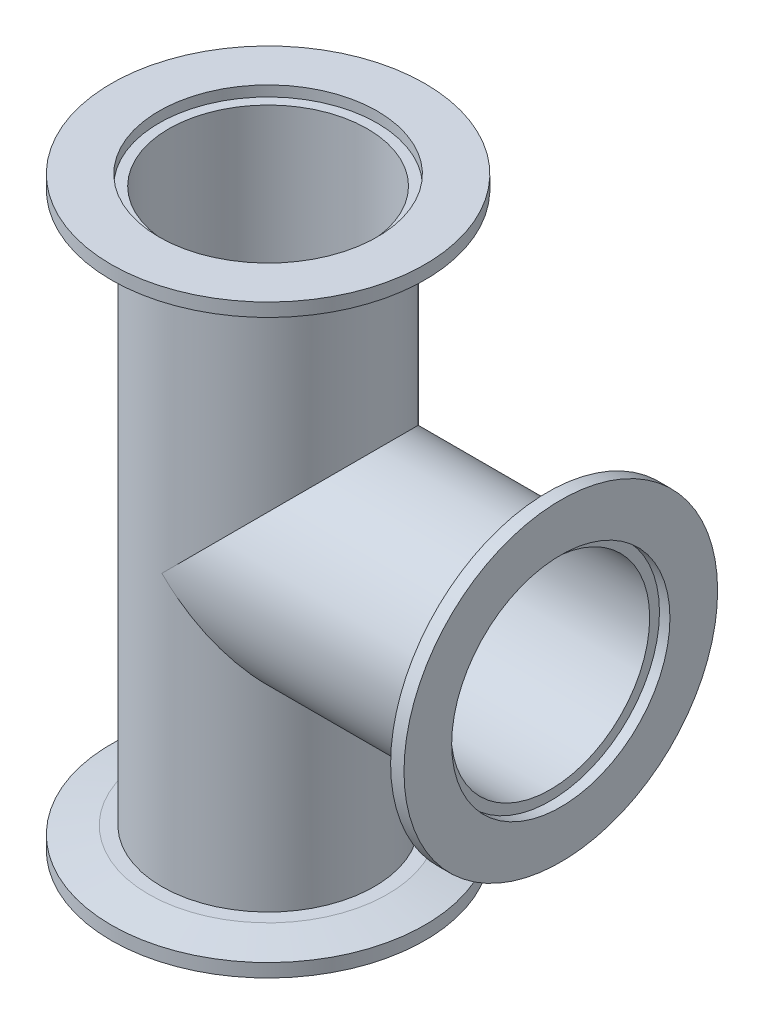
ISO-10303-21;
HEADER;
FILE_DESCRIPTION(('STEP AP214'),'2;1');
FILE_NAME('part.step','',(''),(''),'','','');
FILE_SCHEMA(('AUTOMOTIVE_DESIGN { 1 0 10303 214 1 1 1 1 }'));
ENDSEC;
DATA;
#1=APPLICATION_CONTEXT('core data for automotive mechanical design processes');
#2=APPLICATION_PROTOCOL_DEFINITION('international standard','automotive_design',2000,#1);
#3=PRODUCT_CONTEXT('',#1,'mechanical');
#4=PRODUCT('Part','Part','',(#3));
#5=PRODUCT_RELATED_PRODUCT_CATEGORY('part','',(#4));
#6=PRODUCT_DEFINITION_FORMATION('','',#4);
#7=PRODUCT_DEFINITION_CONTEXT('part definition',#1,'design');
#8=PRODUCT_DEFINITION('design','',#6,#7);
#9=PRODUCT_DEFINITION_SHAPE('','',#8);
#10=(LENGTH_UNIT() NAMED_UNIT(*) SI_UNIT(.MILLI.,.METRE.));
#11=(NAMED_UNIT(*) PLANE_ANGLE_UNIT() SI_UNIT($,.RADIAN.));
#12=(NAMED_UNIT(*) SI_UNIT($,.STERADIAN.) SOLID_ANGLE_UNIT());
#13=UNCERTAINTY_MEASURE_WITH_UNIT(LENGTH_MEASURE(1.E-05),#10,'distance_accuracy_value','');
#14=(GEOMETRIC_REPRESENTATION_CONTEXT(3) GLOBAL_UNCERTAINTY_ASSIGNED_CONTEXT((#13)) GLOBAL_UNIT_ASSIGNED_CONTEXT((#10,
#11,#12)) REPRESENTATION_CONTEXT('',''));
#15=CARTESIAN_POINT('',(0.,0.,0.));
#16=DIRECTION('',(0.,0.,1.));
#17=DIRECTION('',(1.,0.,0.));
#18=AXIS2_PLACEMENT_3D('',#15,#16,#17);
#19=CARTESIAN_POINT('',(0.,-70.,26.1));
#20=DIRECTION('',(0.,-1.,0.));
#21=DIRECTION('',(0.,0.,-1.));
#22=AXIS2_PLACEMENT_3D('',#19,#20,#21);
#23=PLANE('',#22);
#24=CARTESIAN_POINT('',(0.,-70.,0.));
#25=DIRECTION('',(0.,1.,0.));
#26=DIRECTION('',(0.,0.,1.));
#27=AXIS2_PLACEMENT_3D('',#24,#25,#26);
#28=CIRCLE('',#27,26.1);
#29=CARTESIAN_POINT('',(0.,-70.,26.1));
#30=VERTEX_POINT('',#29);
#31=EDGE_CURVE('E111',#30,#30,#28,.T.);
#32=ORIENTED_EDGE('',*,*,#31,.T.);
#33=EDGE_LOOP('',(#32));
#34=FACE_BOUND('',#33,.T.);
#35=CARTESIAN_POINT('',(0.,-70.,0.));
#36=DIRECTION('',(0.,1.,0.));
#37=DIRECTION('',(0.,0.,1.));
#38=AXIS2_PLACEMENT_3D('',#35,#36,#37);
#39=CIRCLE('',#38,37.5);
#40=CARTESIAN_POINT('',(0.,-70.,37.5));
#41=VERTEX_POINT('',#40);
#42=EDGE_CURVE('E114',#41,#41,#39,.T.);
#43=ORIENTED_EDGE('',*,*,#42,.F.);
#44=EDGE_LOOP('',(#43));
#45=FACE_BOUND('',#44,.T.);
#46=ADVANCED_FACE('F36',(#34,#45),#23,.T.);
#47=CARTESIAN_POINT('',(0.,0.,0.));
#48=DIRECTION('',(0.,1.,0.));
#49=DIRECTION('',(0.,0.,1.));
#50=AXIS2_PLACEMENT_3D('',#47,#48,#49);
#51=CYLINDRICAL_SURFACE('',#50,37.5);
#52=ORIENTED_EDGE('',*,*,#42,.T.);
#53=EDGE_LOOP('',(#52));
#54=FACE_BOUND('',#53,.T.);
#55=CARTESIAN_POINT('',(0.,-66.8,0.));
#56=DIRECTION('',(0.,1.,0.));
#57=DIRECTION('',(0.,0.,1.));
#58=AXIS2_PLACEMENT_3D('',#55,#56,#57);
#59=CIRCLE('',#58,37.5);
#60=CARTESIAN_POINT('',(0.,-66.8,37.5));
#61=VERTEX_POINT('',#60);
#62=EDGE_CURVE('E123',#61,#61,#59,.T.);
#63=ORIENTED_EDGE('',*,*,#62,.F.);
#64=EDGE_LOOP('',(#63));
#65=FACE_BOUND('',#64,.T.);
#66=ADVANCED_FACE('F129',(#54,#65),#51,.T.);
#67=CARTESIAN_POINT('',(0.,-64.9,0.));
#68=DIRECTION('',(0.,-1.,0.));
#69=DIRECTION('',(0.,0.,-1.));
#70=AXIS2_PLACEMENT_3D('',#67,#68,#69);
#71=CONICAL_SURFACE('',#70,28.5612027919908,1.36135681655558);
#72=ORIENTED_EDGE('',*,*,#62,.T.);
#73=EDGE_LOOP('',(#72));
#74=FACE_BOUND('',#73,.T.);
#75=CARTESIAN_POINT('',(0.,-64.9,0.));
#76=DIRECTION('',(0.,1.,0.));
#77=DIRECTION('',(0.,0.,1.));
#78=AXIS2_PLACEMENT_3D('',#75,#76,#77);
#79=CIRCLE('',#78,28.5612027919908);
#80=CARTESIAN_POINT('',(0.,-64.9,28.5612027919908));
#81=VERTEX_POINT('',#80);
#82=EDGE_CURVE('E120',#81,#81,#79,.T.);
#83=ORIENTED_EDGE('',*,*,#82,.F.);
#84=EDGE_LOOP('',(#83));
#85=FACE_BOUND('',#84,.T.);
#86=ADVANCED_FACE('F137',(#74,#85),#71,.T.);
#87=CARTESIAN_POINT('',(0.,-64.9,28.5612027919908));
#88=DIRECTION('',(0.,1.,0.));
#89=DIRECTION('',(0.,0.,1.));
#90=AXIS2_PLACEMENT_3D('',#87,#88,#89);
#91=PLANE('',#90);
#92=CARTESIAN_POINT('',(0.,-64.9,0.));
#93=DIRECTION('',(0.,1.,0.));
#94=DIRECTION('',(0.,0.,1.));
#95=AXIS2_PLACEMENT_3D('',#92,#93,#94);
#96=CIRCLE('',#95,25.4);
#97=CARTESIAN_POINT('',(0.,-64.9,25.4));
#98=VERTEX_POINT('',#97);
#99=EDGE_CURVE('E44',#98,#98,#96,.T.);
#100=ORIENTED_EDGE('',*,*,#99,.F.);
#101=EDGE_LOOP('',(#100));
#102=FACE_BOUND('',#101,.T.);
#103=ORIENTED_EDGE('',*,*,#82,.T.);
#104=EDGE_LOOP('',(#103));
#105=FACE_BOUND('',#104,.T.);
#106=ADVANCED_FACE('F152',(#102,#105),#91,.T.);
#107=CARTESIAN_POINT('',(0.,-67.5,0.));
#108=DIRECTION('',(0.,-1.,0.));
#109=DIRECTION('',(0.,0.,-1.));
#110=AXIS2_PLACEMENT_3D('',#107,#108,#109);
#111=PLANE('',#110);
#112=CARTESIAN_POINT('',(0.,-67.5,0.));
#113=DIRECTION('',(0.,-1.,0.));
#114=DIRECTION('',(0.,0.,-1.));
#115=AXIS2_PLACEMENT_3D('',#112,#113,#114);
#116=CIRCLE('',#115,23.75);
#117=CARTESIAN_POINT('',(0.,-67.5,-23.75));
#118=VERTEX_POINT('',#117);
#119=EDGE_CURVE('E39',#118,#118,#116,.T.);
#120=ORIENTED_EDGE('',*,*,#119,.F.);
#121=EDGE_LOOP('',(#120));
#122=FACE_BOUND('',#121,.T.);
#123=CARTESIAN_POINT('',(0.,-67.5,0.));
#124=DIRECTION('',(0.,1.,0.));
#125=DIRECTION('',(0.,0.,1.));
#126=AXIS2_PLACEMENT_3D('',#123,#124,#125);
#127=CIRCLE('',#126,26.1);
#128=CARTESIAN_POINT('',(0.,-67.5,26.1));
#129=VERTEX_POINT('',#128);
#130=EDGE_CURVE('E117',#129,#129,#127,.T.);
#131=ORIENTED_EDGE('',*,*,#130,.F.);
#132=EDGE_LOOP('',(#131));
#133=FACE_BOUND('',#132,.T.);
#134=ADVANCED_FACE('F143',(#122,#133),#111,.T.);
#135=CARTESIAN_POINT('',(0.,0.,0.));
#136=DIRECTION('',(0.,1.,0.));
#137=DIRECTION('',(0.,0.,1.));
#138=AXIS2_PLACEMENT_3D('',#135,#136,#137);
#139=CYLINDRICAL_SURFACE('',#138,26.1);
#140=ORIENTED_EDGE('',*,*,#130,.T.);
#141=EDGE_LOOP('',(#140));
#142=FACE_BOUND('',#141,.T.);
#143=ORIENTED_EDGE('',*,*,#31,.F.);
#144=EDGE_LOOP('',(#143));
#145=FACE_BOUND('',#144,.T.);
#146=ADVANCED_FACE('F140',(#142,#145),#139,.F.);
#147=CARTESIAN_POINT('',(0.,71.8420489685532,0.));
#148=DIRECTION('',(0.,-1.,0.));
#149=DIRECTION('',(0.,0.,-1.));
#150=AXIS2_PLACEMENT_3D('',#147,#148,#149);
#151=CYLINDRICAL_SURFACE('',#150,25.4);
#152=CARTESIAN_POINT('',(0.,0.,0.));
#153=DIRECTION('',(-0.707106781186546,-0.707106781186549,0.));
#154=DIRECTION('',(0.707106781186549,-0.707106781186546,0.));
#155=AXIS2_PLACEMENT_3D('',#152,#153,#154);
#156=ELLIPSE('',#155,35.9210244842765,25.4);
#157=CARTESIAN_POINT('',(0.,0.,25.4));
#158=VERTEX_POINT('',#157);
#159=CARTESIAN_POINT('',(0.,0.,-25.4));
#160=VERTEX_POINT('',#159);
#161=EDGE_CURVE('E11',#158,#160,#156,.F.);
#162=ORIENTED_EDGE('',*,*,#161,.F.);
#163=CARTESIAN_POINT('',(0.,0.,0.));
#164=DIRECTION('',(0.707106781186549,-0.707106781186546,0.));
#165=DIRECTION('',(0.707106781186546,0.707106781186549,0.));
#166=AXIS2_PLACEMENT_3D('',#163,#164,#165);
#167=ELLIPSE('',#166,35.9210244842767,25.4);
#168=EDGE_CURVE('E57',#158,#160,#167,.F.);
#169=ORIENTED_EDGE('',*,*,#168,.T.);
#170=EDGE_LOOP('',(#162,#169));
#171=FACE_BOUND('',#170,.T.);
#172=ORIENTED_EDGE('',*,*,#99,.T.);
#173=EDGE_LOOP('',(#172));
#174=FACE_BOUND('',#173,.T.);
#175=CARTESIAN_POINT('',(0.,64.9,0.));
#176=DIRECTION('',(0.,-1.,0.));
#177=DIRECTION('',(0.,0.,1.));
#178=AXIS2_PLACEMENT_3D('',#175,#176,#177);
#179=CIRCLE('',#178,25.4);
#180=CARTESIAN_POINT('',(0.,64.9,25.4));
#181=VERTEX_POINT('',#180);
#182=EDGE_CURVE('E75',#181,#181,#179,.T.);
#183=ORIENTED_EDGE('',*,*,#182,.T.);
#184=EDGE_LOOP('',(#183));
#185=FACE_BOUND('',#184,.T.);
#186=ADVANCED_FACE('F142',(#171,#174,#185),#151,.T.);
#187=CARTESIAN_POINT('',(70.,2.44403693719019E-13,26.1));
#188=DIRECTION('',(1.,0.,0.));
#189=DIRECTION('',(0.,0.,-1.));
#190=AXIS2_PLACEMENT_3D('',#187,#188,#189);
#191=PLANE('',#190);
#192=CARTESIAN_POINT('',(70.,2.44403693719019E-13,0.));
#193=DIRECTION('',(-1.,0.,0.));
#194=DIRECTION('',(0.,0.,1.));
#195=AXIS2_PLACEMENT_3D('',#192,#193,#194);
#196=CIRCLE('',#195,26.1);
#197=CARTESIAN_POINT('',(70.,2.44403693719019E-13,26.1));
#198=VERTEX_POINT('',#197);
#199=EDGE_CURVE('E78',#198,#198,#196,.T.);
#200=ORIENTED_EDGE('',*,*,#199,.T.);
#201=EDGE_LOOP('',(#200));
#202=FACE_BOUND('',#201,.T.);
#203=CARTESIAN_POINT('',(70.,2.44403693719019E-13,0.));
#204=DIRECTION('',(-1.,0.,0.));
#205=DIRECTION('',(0.,0.,1.));
#206=AXIS2_PLACEMENT_3D('',#203,#204,#205);
#207=CIRCLE('',#206,37.5);
#208=CARTESIAN_POINT('',(70.,2.44403693719019E-13,37.5));
#209=VERTEX_POINT('',#208);
#210=EDGE_CURVE('E96',#209,#209,#207,.T.);
#211=ORIENTED_EDGE('',*,*,#210,.F.);
#212=EDGE_LOOP('',(#211));
#213=FACE_BOUND('',#212,.T.);
#214=ADVANCED_FACE('F150',(#202,#213),#191,.T.);
#215=CARTESIAN_POINT('',(0.,0.,0.));
#216=DIRECTION('',(-1.,0.,0.));
#217=DIRECTION('',(0.,0.,1.));
#218=AXIS2_PLACEMENT_3D('',#215,#216,#217);
#219=CYLINDRICAL_SURFACE('',#218,37.5);
#220=ORIENTED_EDGE('',*,*,#210,.T.);
#221=EDGE_LOOP('',(#220));
#222=FACE_BOUND('',#221,.T.);
#223=CARTESIAN_POINT('',(66.8,2.33230953434721E-13,0.));
#224=DIRECTION('',(-1.,0.,0.));
#225=DIRECTION('',(0.,0.,1.));
#226=AXIS2_PLACEMENT_3D('',#223,#224,#225);
#227=CIRCLE('',#226,37.5);
#228=CARTESIAN_POINT('',(66.8,2.33230953434721E-13,37.5));
#229=VERTEX_POINT('',#228);
#230=EDGE_CURVE('E105',#229,#229,#227,.T.);
#231=ORIENTED_EDGE('',*,*,#230,.F.);
#232=EDGE_LOOP('',(#231));
#233=FACE_BOUND('',#232,.T.);
#234=ADVANCED_FACE('F265',(#222,#233),#219,.T.);
#235=CARTESIAN_POINT('',(64.9,2.26597138890919E-13,0.));
#236=DIRECTION('',(1.,0.,0.));
#237=DIRECTION('',(0.,0.,-1.));
#238=AXIS2_PLACEMENT_3D('',#235,#236,#237);
#239=CONICAL_SURFACE('',#238,28.5612027919908,1.36135681655558);
#240=ORIENTED_EDGE('',*,*,#230,.T.);
#241=EDGE_LOOP('',(#240));
#242=FACE_BOUND('',#241,.T.);
#243=CARTESIAN_POINT('',(64.9,2.26597138890919E-13,0.));
#244=DIRECTION('',(-1.,0.,0.));
#245=DIRECTION('',(0.,0.,1.));
#246=AXIS2_PLACEMENT_3D('',#243,#244,#245);
#247=CIRCLE('',#246,28.5612027919908);
#248=CARTESIAN_POINT('',(64.9,2.26597138890919E-13,28.5612027919908));
#249=VERTEX_POINT('',#248);
#250=EDGE_CURVE('E102',#249,#249,#247,.T.);
#251=ORIENTED_EDGE('',*,*,#250,.F.);
#252=EDGE_LOOP('',(#251));
#253=FACE_BOUND('',#252,.T.);
#254=ADVANCED_FACE('F261',(#242,#253),#239,.T.);
#255=CARTESIAN_POINT('',(64.9,2.26597138890919E-13,28.5612027919908));
#256=DIRECTION('',(-1.,0.,0.));
#257=DIRECTION('',(0.,0.,1.));
#258=AXIS2_PLACEMENT_3D('',#255,#256,#257);
#259=PLANE('',#258);
#260=CARTESIAN_POINT('',(64.9,2.26597138890919E-13,0.));
#261=DIRECTION('',(-1.,0.,0.));
#262=DIRECTION('',(0.,0.,1.));
#263=AXIS2_PLACEMENT_3D('',#260,#261,#262);
#264=CIRCLE('',#263,25.4);
#265=CARTESIAN_POINT('',(64.9,2.26597138890919E-13,25.4));
#266=VERTEX_POINT('',#265);
#267=EDGE_CURVE('E93',#266,#266,#264,.T.);
#268=ORIENTED_EDGE('',*,*,#267,.F.);
#269=EDGE_LOOP('',(#268));
#270=FACE_BOUND('',#269,.T.);
#271=ORIENTED_EDGE('',*,*,#250,.T.);
#272=EDGE_LOOP('',(#271));
#273=FACE_BOUND('',#272,.T.);
#274=ADVANCED_FACE('F197',(#270,#273),#259,.T.);
#275=CARTESIAN_POINT('',(67.5,2.35674990371912E-13,0.));
#276=DIRECTION('',(1.,0.,0.));
#277=DIRECTION('',(0.,0.,-1.));
#278=AXIS2_PLACEMENT_3D('',#275,#276,#277);
#279=PLANE('',#278);
#280=CARTESIAN_POINT('',(67.5,2.35674990371912E-13,0.));
#281=DIRECTION('',(1.,0.,0.));
#282=DIRECTION('',(0.,0.,-1.));
#283=AXIS2_PLACEMENT_3D('',#280,#281,#282);
#284=CIRCLE('',#283,23.75);
#285=CARTESIAN_POINT('',(67.5,2.35674990371912E-13,-23.75));
#286=VERTEX_POINT('',#285);
#287=EDGE_CURVE('E64',#286,#286,#284,.T.);
#288=ORIENTED_EDGE('',*,*,#287,.F.);
#289=EDGE_LOOP('',(#288));
#290=FACE_BOUND('',#289,.T.);
#291=CARTESIAN_POINT('',(67.5,2.35674990371912E-13,0.));
#292=DIRECTION('',(-1.,0.,0.));
#293=DIRECTION('',(0.,0.,1.));
#294=AXIS2_PLACEMENT_3D('',#291,#292,#293);
#295=CIRCLE('',#294,26.1);
#296=CARTESIAN_POINT('',(67.5,2.35674990371912E-13,26.1));
#297=VERTEX_POINT('',#296);
#298=EDGE_CURVE('E99',#297,#297,#295,.T.);
#299=ORIENTED_EDGE('',*,*,#298,.F.);
#300=EDGE_LOOP('',(#299));
#301=FACE_BOUND('',#300,.T.);
#302=ADVANCED_FACE('F191',(#290,#301),#279,.T.);
#303=CARTESIAN_POINT('',(0.,0.,0.));
#304=DIRECTION('',(-1.,0.,0.));
#305=DIRECTION('',(0.,0.,1.));
#306=AXIS2_PLACEMENT_3D('',#303,#304,#305);
#307=CYLINDRICAL_SURFACE('',#306,26.1);
#308=ORIENTED_EDGE('',*,*,#298,.T.);
#309=EDGE_LOOP('',(#308));
#310=FACE_BOUND('',#309,.T.);
#311=ORIENTED_EDGE('',*,*,#199,.F.);
#312=EDGE_LOOP('',(#311));
#313=FACE_BOUND('',#312,.T.);
#314=ADVANCED_FACE('F196',(#310,#313),#307,.F.);
#315=CARTESIAN_POINT('',(-71.8420489685532,-2.50835173317958E-13,0.));
#316=DIRECTION('',(1.,0.,0.));
#317=DIRECTION('',(0.,0.,-1.));
#318=AXIS2_PLACEMENT_3D('',#315,#316,#317);
#319=CYLINDRICAL_SURFACE('',#318,25.4);
#320=ORIENTED_EDGE('',*,*,#168,.F.);
#321=ORIENTED_EDGE('',*,*,#161,.T.);
#322=EDGE_LOOP('',(#320,#321));
#323=FACE_BOUND('',#322,.T.);
#324=ORIENTED_EDGE('',*,*,#267,.T.);
#325=EDGE_LOOP('',(#324));
#326=FACE_BOUND('',#325,.T.);
#327=ADVANCED_FACE('F253',(#323,#326),#319,.T.);
#328=CARTESIAN_POINT('',(0.,70.,26.1));
#329=DIRECTION('',(0.,1.,0.));
#330=DIRECTION('',(0.,0.,-1.));
#331=AXIS2_PLACEMENT_3D('',#328,#329,#330);
#332=PLANE('',#331);
#333=CARTESIAN_POINT('',(0.,70.,0.));
#334=DIRECTION('',(0.,-1.,0.));
#335=DIRECTION('',(0.,0.,1.));
#336=AXIS2_PLACEMENT_3D('',#333,#334,#335);
#337=CIRCLE('',#336,26.1);
#338=CARTESIAN_POINT('',(0.,70.,26.1));
#339=VERTEX_POINT('',#338);
#340=EDGE_CURVE('E71',#339,#339,#337,.T.);
#341=ORIENTED_EDGE('',*,*,#340,.T.);
#342=EDGE_LOOP('',(#341));
#343=FACE_BOUND('',#342,.T.);
#344=CARTESIAN_POINT('',(0.,70.,0.));
#345=DIRECTION('',(0.,-1.,0.));
#346=DIRECTION('',(0.,0.,1.));
#347=AXIS2_PLACEMENT_3D('',#344,#345,#346);
#348=CIRCLE('',#347,37.5);
#349=CARTESIAN_POINT('',(0.,70.,37.5));
#350=VERTEX_POINT('',#349);
#351=EDGE_CURVE('E79',#350,#350,#348,.T.);
#352=ORIENTED_EDGE('',*,*,#351,.F.);
#353=EDGE_LOOP('',(#352));
#354=FACE_BOUND('',#353,.T.);
#355=ADVANCED_FACE('F249',(#343,#354),#332,.T.);
#356=CARTESIAN_POINT('',(0.,0.,0.));
#357=DIRECTION('',(0.,-1.,0.));
#358=DIRECTION('',(0.,0.,1.));
#359=AXIS2_PLACEMENT_3D('',#356,#357,#358);
#360=CYLINDRICAL_SURFACE('',#359,37.5);
#361=ORIENTED_EDGE('',*,*,#351,.T.);
#362=EDGE_LOOP('',(#361));
#363=FACE_BOUND('',#362,.T.);
#364=CARTESIAN_POINT('',(0.,66.8,0.));
#365=DIRECTION('',(0.,-1.,0.));
#366=DIRECTION('',(0.,0.,1.));
#367=AXIS2_PLACEMENT_3D('',#364,#365,#366);
#368=CIRCLE('',#367,37.5);
#369=CARTESIAN_POINT('',(0.,66.8,37.5));
#370=VERTEX_POINT('',#369);
#371=EDGE_CURVE('E88',#370,#370,#368,.T.);
#372=ORIENTED_EDGE('',*,*,#371,.F.);
#373=EDGE_LOOP('',(#372));
#374=FACE_BOUND('',#373,.T.);
#375=ADVANCED_FACE('F245',(#363,#374),#360,.T.);
#376=CARTESIAN_POINT('',(0.,64.9,0.));
#377=DIRECTION('',(0.,1.,0.));
#378=DIRECTION('',(0.,0.,-1.));
#379=AXIS2_PLACEMENT_3D('',#376,#377,#378);
#380=CONICAL_SURFACE('',#379,28.5612027919908,1.36135681655558);
#381=ORIENTED_EDGE('',*,*,#371,.T.);
#382=EDGE_LOOP('',(#381));
#383=FACE_BOUND('',#382,.T.);
#384=CARTESIAN_POINT('',(0.,64.9,0.));
#385=DIRECTION('',(0.,-1.,0.));
#386=DIRECTION('',(0.,0.,1.));
#387=AXIS2_PLACEMENT_3D('',#384,#385,#386);
#388=CIRCLE('',#387,28.5612027919908);
#389=CARTESIAN_POINT('',(0.,64.9,28.5612027919908));
#390=VERTEX_POINT('',#389);
#391=EDGE_CURVE('E85',#390,#390,#388,.T.);
#392=ORIENTED_EDGE('',*,*,#391,.F.);
#393=EDGE_LOOP('',(#392));
#394=FACE_BOUND('',#393,.T.);
#395=ADVANCED_FACE('F241',(#383,#394),#380,.T.);
#396=CARTESIAN_POINT('',(0.,64.9,28.5612027919908));
#397=DIRECTION('',(0.,-1.,0.));
#398=DIRECTION('',(0.,0.,1.));
#399=AXIS2_PLACEMENT_3D('',#396,#397,#398);
#400=PLANE('',#399);
#401=ORIENTED_EDGE('',*,*,#182,.F.);
#402=EDGE_LOOP('',(#401));
#403=FACE_BOUND('',#402,.T.);
#404=ORIENTED_EDGE('',*,*,#391,.T.);
#405=EDGE_LOOP('',(#404));
#406=FACE_BOUND('',#405,.T.);
#407=ADVANCED_FACE('F211',(#403,#406),#400,.T.);
#408=CARTESIAN_POINT('',(0.,67.5,0.));
#409=DIRECTION('',(0.,1.,0.));
#410=DIRECTION('',(0.,0.,-1.));
#411=AXIS2_PLACEMENT_3D('',#408,#409,#410);
#412=PLANE('',#411);
#413=CARTESIAN_POINT('',(0.,67.5,0.));
#414=DIRECTION('',(0.,1.,0.));
#415=DIRECTION('',(0.,0.,-1.));
#416=AXIS2_PLACEMENT_3D('',#413,#414,#415);
#417=CIRCLE('',#416,23.75);
#418=CARTESIAN_POINT('',(0.,67.5,-23.75));
#419=VERTEX_POINT('',#418);
#420=EDGE_CURVE('E65',#419,#419,#417,.T.);
#421=ORIENTED_EDGE('',*,*,#420,.F.);
#422=EDGE_LOOP('',(#421));
#423=FACE_BOUND('',#422,.T.);
#424=CARTESIAN_POINT('',(0.,67.5,0.));
#425=DIRECTION('',(0.,-1.,0.));
#426=DIRECTION('',(0.,0.,1.));
#427=AXIS2_PLACEMENT_3D('',#424,#425,#426);
#428=CIRCLE('',#427,26.1);
#429=CARTESIAN_POINT('',(0.,67.5,26.1));
#430=VERTEX_POINT('',#429);
#431=EDGE_CURVE('E82',#430,#430,#428,.T.);
#432=ORIENTED_EDGE('',*,*,#431,.F.);
#433=EDGE_LOOP('',(#432));
#434=FACE_BOUND('',#433,.T.);
#435=ADVANCED_FACE('F206',(#423,#434),#412,.T.);
#436=CARTESIAN_POINT('',(0.,0.,0.));
#437=DIRECTION('',(0.,-1.,0.));
#438=DIRECTION('',(0.,0.,1.));
#439=AXIS2_PLACEMENT_3D('',#436,#437,#438);
#440=CYLINDRICAL_SURFACE('',#439,26.1);
#441=ORIENTED_EDGE('',*,*,#431,.T.);
#442=EDGE_LOOP('',(#441));
#443=FACE_BOUND('',#442,.T.);
#444=ORIENTED_EDGE('',*,*,#340,.F.);
#445=EDGE_LOOP('',(#444));
#446=FACE_BOUND('',#445,.T.);
#447=ADVANCED_FACE('F186',(#443,#446),#440,.F.);
#448=CARTESIAN_POINT('',(0.,-70.,0.));
#449=DIRECTION('',(0.,1.,0.));
#450=DIRECTION('',(0.,0.,1.));
#451=AXIS2_PLACEMENT_3D('',#448,#449,#450);
#452=CYLINDRICAL_SURFACE('',#451,23.75);
#453=ORIENTED_EDGE('',*,*,#119,.T.);
#454=EDGE_LOOP('',(#453));
#455=FACE_BOUND('',#454,.T.);
#456=CARTESIAN_POINT('',(0.,0.,0.));
#457=DIRECTION('',(0.707106781186546,0.707106781186549,0.));
#458=DIRECTION('',(-0.707106781186549,0.707106781186546,0.));
#459=AXIS2_PLACEMENT_3D('',#456,#457,#458);
#460=ELLIPSE('',#459,33.587572106361,23.75);
#461=CARTESIAN_POINT('',(0.,0.,23.75));
#462=VERTEX_POINT('',#461);
#463=CARTESIAN_POINT('',(0.,0.,-23.75));
#464=VERTEX_POINT('',#463);
#465=EDGE_CURVE('E63',#462,#464,#460,.T.);
#466=ORIENTED_EDGE('',*,*,#465,.T.);
#467=CARTESIAN_POINT('',(0.,0.,0.));
#468=DIRECTION('',(-0.707106781186549,0.707106781186546,0.));
#469=DIRECTION('',(-0.707106781186546,-0.707106781186549,0.));
#470=AXIS2_PLACEMENT_3D('',#467,#468,#469);
#471=ELLIPSE('',#470,33.5875721063611,23.75);
#472=EDGE_CURVE('E50',#462,#464,#471,.T.);
#473=ORIENTED_EDGE('',*,*,#472,.F.);
#474=EDGE_LOOP('',(#466,#473));
#475=FACE_BOUND('',#474,.T.);
#476=ORIENTED_EDGE('',*,*,#420,.T.);
#477=EDGE_LOOP('',(#476));
#478=FACE_BOUND('',#477,.T.);
#479=ADVANCED_FACE('F67',(#455,#475,#478),#452,.F.);
#480=CARTESIAN_POINT('',(70.,2.44403693719019E-13,0.));
#481=DIRECTION('',(-1.,0.,0.));
#482=DIRECTION('',(0.,0.,1.));
#483=AXIS2_PLACEMENT_3D('',#480,#481,#482);
#484=CYLINDRICAL_SURFACE('',#483,23.75);
#485=ORIENTED_EDGE('',*,*,#287,.T.);
#486=EDGE_LOOP('',(#485));
#487=FACE_BOUND('',#486,.T.);
#488=ORIENTED_EDGE('',*,*,#472,.T.);
#489=ORIENTED_EDGE('',*,*,#465,.F.);
#490=EDGE_LOOP('',(#488,#489));
#491=FACE_BOUND('',#490,.T.);
#492=ADVANCED_FACE('F62',(#487,#491),#484,.F.);
#493=CLOSED_SHELL('',(#46,#66,#86,#106,#134,#146,#186,#214,#234,#254,#274,#302,#314,#327,#355,
#375,#395,#407,#435,#447,#479,#492));
#494=MANIFOLD_SOLID_BREP('B2',#493);
#495=ADVANCED_BREP_SHAPE_REPRESENTATION('',(#18,#494),#14);
#496=SHAPE_DEFINITION_REPRESENTATION(#9,#495);
ENDSEC;
END-ISO-10303-21;
